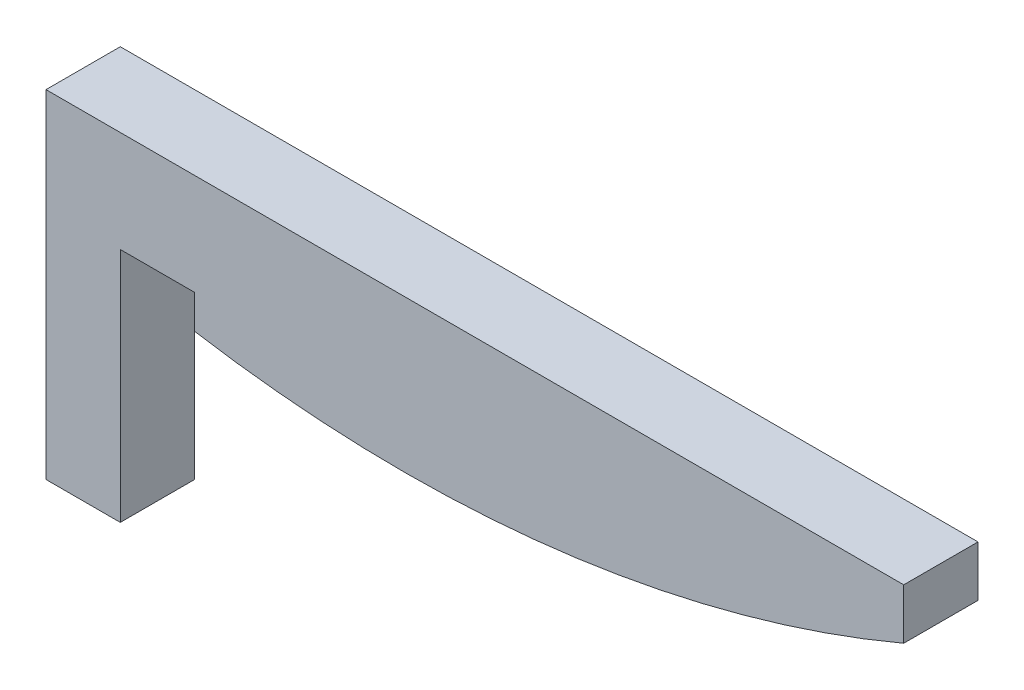
ISO-10303-21;
HEADER;
FILE_DESCRIPTION(('STEP AP214'),'2;1');
FILE_NAME('part.step','',(''),(''),'','','');
FILE_SCHEMA(('AUTOMOTIVE_DESIGN { 1 0 10303 214 1 1 1 1 }'));
ENDSEC;
DATA;
#1=APPLICATION_CONTEXT('core data for automotive mechanical design processes');
#2=APPLICATION_PROTOCOL_DEFINITION('international standard','automotive_design',2000,#1);
#3=PRODUCT_CONTEXT('',#1,'mechanical');
#4=PRODUCT('Part','Part','',(#3));
#5=PRODUCT_RELATED_PRODUCT_CATEGORY('part','',(#4));
#6=PRODUCT_DEFINITION_FORMATION('','',#4);
#7=PRODUCT_DEFINITION_CONTEXT('part definition',#1,'design');
#8=PRODUCT_DEFINITION('design','',#6,#7);
#9=PRODUCT_DEFINITION_SHAPE('','',#8);
#10=(LENGTH_UNIT() NAMED_UNIT(*) SI_UNIT(.MILLI.,.METRE.));
#11=(NAMED_UNIT(*) PLANE_ANGLE_UNIT() SI_UNIT($,.RADIAN.));
#12=(NAMED_UNIT(*) SI_UNIT($,.STERADIAN.) SOLID_ANGLE_UNIT());
#13=UNCERTAINTY_MEASURE_WITH_UNIT(LENGTH_MEASURE(1.E-05),#10,'distance_accuracy_value','');
#14=(GEOMETRIC_REPRESENTATION_CONTEXT(3) GLOBAL_UNCERTAINTY_ASSIGNED_CONTEXT((#13)) GLOBAL_UNIT_ASSIGNED_CONTEXT((#10,
#11,#12)) REPRESENTATION_CONTEXT('',''));
#15=CARTESIAN_POINT('',(0.,0.,0.));
#16=DIRECTION('',(0.,0.,1.));
#17=DIRECTION('',(1.,0.,0.));
#18=AXIS2_PLACEMENT_3D('',#15,#16,#17);
#19=CARTESIAN_POINT('',(96.6069144444629,71.1082138760036,0.));
#20=DIRECTION('',(0.,0.,1.));
#21=DIRECTION('',(1.,0.,0.));
#22=AXIS2_PLACEMENT_3D('',#19,#20,#21);
#23=PLANE('',#22);
#24=DIRECTION('',(-1.,0.,0.));
#25=VECTOR('',#24,1.);
#26=CARTESIAN_POINT('',(254.,100.,0.));
#27=LINE('',#26,#25);
#28=CARTESIAN_POINT('',(254.,100.,0.));
#29=VERTEX_POINT('',#28);
#30=CARTESIAN_POINT('',(0.,99.9999999999999,0.));
#31=VERTEX_POINT('',#30);
#32=EDGE_CURVE('E83',#29,#31,#27,.T.);
#33=ORIENTED_EDGE('',*,*,#32,.F.);
#34=DIRECTION('',(0.,1.,0.));
#35=VECTOR('',#34,1.);
#36=CARTESIAN_POINT('',(254.,85.,0.));
#37=LINE('',#36,#35);
#38=CARTESIAN_POINT('',(254.,84.9999999999997,0.));
#39=VERTEX_POINT('',#38);
#40=EDGE_CURVE('E81',#39,#29,#37,.T.);
#41=ORIENTED_EDGE('',*,*,#40,.F.);
#42=CARTESIAN_POINT('',(105.853307336964,434.932218369506,0.));
#43=DIRECTION('',(0.,0.,1.));
#44=DIRECTION('',(1.,0.,0.));
#45=AXIS2_PLACEMENT_3D('',#42,#43,#44);
#46=CIRCLE('',#45,380.);
#47=CARTESIAN_POINT('',(43.9999999999999,59.9999999999998,0.));
#48=VERTEX_POINT('',#47);
#49=EDGE_CURVE('E20',#48,#39,#46,.T.);
#50=ORIENTED_EDGE('',*,*,#49,.F.);
#51=DIRECTION('',(0.,1.,0.));
#52=VECTOR('',#51,1.);
#53=CARTESIAN_POINT('',(44.,70.,0.));
#54=LINE('',#53,#52);
#55=CARTESIAN_POINT('',(44.,70.,0.));
#56=VERTEX_POINT('',#55);
#57=EDGE_CURVE('E112',#56,#48,#54,.F.);
#58=ORIENTED_EDGE('',*,*,#57,.F.);
#59=DIRECTION('',(1.,0.,0.));
#60=VECTOR('',#59,1.);
#61=CARTESIAN_POINT('',(22.,70.,0.));
#62=LINE('',#61,#60);
#63=CARTESIAN_POINT('',(22.,70.,0.));
#64=VERTEX_POINT('',#63);
#65=EDGE_CURVE('E125',#64,#56,#62,.T.);
#66=ORIENTED_EDGE('',*,*,#65,.F.);
#67=DIRECTION('',(0.,1.,0.));
#68=VECTOR('',#67,1.);
#69=CARTESIAN_POINT('',(22.,0.,0.));
#70=LINE('',#69,#68);
#71=CARTESIAN_POINT('',(22.,0.,0.));
#72=VERTEX_POINT('',#71);
#73=EDGE_CURVE('E136',#72,#64,#70,.T.);
#74=ORIENTED_EDGE('',*,*,#73,.F.);
#75=DIRECTION('',(1.,0.,0.));
#76=VECTOR('',#75,1.);
#77=CARTESIAN_POINT('',(0.,0.,0.));
#78=LINE('',#77,#76);
#79=CARTESIAN_POINT('',(0.,0.,0.));
#80=VERTEX_POINT('',#79);
#81=EDGE_CURVE('E146',#80,#72,#78,.T.);
#82=ORIENTED_EDGE('',*,*,#81,.F.);
#83=DIRECTION('',(0.,1.,0.));
#84=VECTOR('',#83,1.);
#85=CARTESIAN_POINT('',(0.,100.,0.));
#86=LINE('',#85,#84);
#87=EDGE_CURVE('E161',#31,#80,#86,.F.);
#88=ORIENTED_EDGE('',*,*,#87,.F.);
#89=EDGE_LOOP('',(#33,#41,#50,#58,#66,#74,#82,#88));
#90=FACE_BOUND('',#89,.T.);
#91=ADVANCED_FACE('F17',(#90),#23,.F.);
#92=CARTESIAN_POINT('',(0.,100.,0.));
#93=DIRECTION('',(-1.,0.,0.));
#94=DIRECTION('',(0.,0.,1.));
#95=AXIS2_PLACEMENT_3D('',#92,#93,#94);
#96=PLANE('',#95);
#97=DIRECTION('',(0.,1.,0.));
#98=VECTOR('',#97,1.);
#99=CARTESIAN_POINT('',(0.,71.1082138760036,22.));
#100=LINE('',#99,#98);
#101=CARTESIAN_POINT('',(0.,100.,22.));
#102=VERTEX_POINT('',#101);
#103=CARTESIAN_POINT('',(0.,0.,22.));
#104=VERTEX_POINT('',#103);
#105=EDGE_CURVE('E106',#102,#104,#100,.F.);
#106=ORIENTED_EDGE('',*,*,#105,.F.);
#107=DIRECTION('',(0.,0.,1.));
#108=VECTOR('',#107,1.);
#109=CARTESIAN_POINT('',(0.,100.,0.));
#110=LINE('',#109,#108);
#111=EDGE_CURVE('E97',#31,#102,#110,.T.);
#112=ORIENTED_EDGE('',*,*,#111,.F.);
#113=ORIENTED_EDGE('',*,*,#87,.T.);
#114=DIRECTION('',(0.,0.,-1.));
#115=VECTOR('',#114,1.);
#116=CARTESIAN_POINT('',(0.,0.,0.));
#117=LINE('',#116,#115);
#118=EDGE_CURVE('E143',#104,#80,#117,.T.);
#119=ORIENTED_EDGE('',*,*,#118,.F.);
#120=EDGE_LOOP('',(#106,#112,#113,#119));
#121=FACE_BOUND('',#120,.T.);
#122=ADVANCED_FACE('F200',(#121),#96,.T.);
#123=CARTESIAN_POINT('',(0.,0.,0.));
#124=DIRECTION('',(0.,-1.,0.));
#125=DIRECTION('',(0.,0.,-1.));
#126=AXIS2_PLACEMENT_3D('',#123,#124,#125);
#127=PLANE('',#126);
#128=DIRECTION('',(1.,0.,0.));
#129=VECTOR('',#128,1.);
#130=CARTESIAN_POINT('',(96.6069144444629,0.,22.));
#131=LINE('',#130,#129);
#132=CARTESIAN_POINT('',(22.,0.,22.));
#133=VERTEX_POINT('',#132);
#134=EDGE_CURVE('E130',#104,#133,#131,.T.);
#135=ORIENTED_EDGE('',*,*,#134,.F.);
#136=ORIENTED_EDGE('',*,*,#118,.T.);
#137=ORIENTED_EDGE('',*,*,#81,.T.);
#138=DIRECTION('',(0.,0.,1.));
#139=VECTOR('',#138,1.);
#140=CARTESIAN_POINT('',(22.,0.,0.));
#141=LINE('',#140,#139);
#142=EDGE_CURVE('E133',#133,#72,#141,.F.);
#143=ORIENTED_EDGE('',*,*,#142,.F.);
#144=EDGE_LOOP('',(#135,#136,#137,#143));
#145=FACE_BOUND('',#144,.T.);
#146=ADVANCED_FACE('F198',(#145),#127,.T.);
#147=CARTESIAN_POINT('',(22.,0.,0.));
#148=DIRECTION('',(1.,0.,0.));
#149=DIRECTION('',(0.,1.,0.));
#150=AXIS2_PLACEMENT_3D('',#147,#148,#149);
#151=PLANE('',#150);
#152=DIRECTION('',(0.,1.,0.));
#153=VECTOR('',#152,1.);
#154=CARTESIAN_POINT('',(22.,71.1082138760036,22.));
#155=LINE('',#154,#153);
#156=CARTESIAN_POINT('',(22.,70.,22.));
#157=VERTEX_POINT('',#156);
#158=EDGE_CURVE('E119',#133,#157,#155,.T.);
#159=ORIENTED_EDGE('',*,*,#158,.F.);
#160=ORIENTED_EDGE('',*,*,#142,.T.);
#161=ORIENTED_EDGE('',*,*,#73,.T.);
#162=DIRECTION('',(0.,0.,1.));
#163=VECTOR('',#162,1.);
#164=CARTESIAN_POINT('',(22.,70.,0.));
#165=LINE('',#164,#163);
#166=EDGE_CURVE('E122',#157,#64,#165,.F.);
#167=ORIENTED_EDGE('',*,*,#166,.F.);
#168=EDGE_LOOP('',(#159,#160,#161,#167));
#169=FACE_BOUND('',#168,.T.);
#170=ADVANCED_FACE('F195',(#169),#151,.T.);
#171=CARTESIAN_POINT('',(22.,70.,0.));
#172=DIRECTION('',(0.,-1.,0.));
#173=DIRECTION('',(1.,0.,0.));
#174=AXIS2_PLACEMENT_3D('',#171,#172,#173);
#175=PLANE('',#174);
#176=DIRECTION('',(1.,0.,0.));
#177=VECTOR('',#176,1.);
#178=CARTESIAN_POINT('',(96.6069144444629,70.,22.));
#179=LINE('',#178,#177);
#180=CARTESIAN_POINT('',(44.,70.,22.));
#181=VERTEX_POINT('',#180);
#182=EDGE_CURVE('E115',#157,#181,#179,.T.);
#183=ORIENTED_EDGE('',*,*,#182,.F.);
#184=ORIENTED_EDGE('',*,*,#166,.T.);
#185=ORIENTED_EDGE('',*,*,#65,.T.);
#186=DIRECTION('',(0.,0.,1.));
#187=VECTOR('',#186,1.);
#188=CARTESIAN_POINT('',(44.,70.,0.));
#189=LINE('',#188,#187);
#190=EDGE_CURVE('E92',#181,#56,#189,.F.);
#191=ORIENTED_EDGE('',*,*,#190,.F.);
#192=EDGE_LOOP('',(#183,#184,#185,#191));
#193=FACE_BOUND('',#192,.T.);
#194=ADVANCED_FACE('F192',(#193),#175,.T.);
#195=CARTESIAN_POINT('',(44.,70.,0.));
#196=DIRECTION('',(-1.,0.,0.));
#197=DIRECTION('',(0.,0.,1.));
#198=AXIS2_PLACEMENT_3D('',#195,#196,#197);
#199=PLANE('',#198);
#200=DIRECTION('',(0.,1.,0.));
#201=VECTOR('',#200,1.);
#202=CARTESIAN_POINT('',(44.,71.1082138760036,22.));
#203=LINE('',#202,#201);
#204=CARTESIAN_POINT('',(43.9999999999999,59.9999999999998,22.));
#205=VERTEX_POINT('',#204);
#206=EDGE_CURVE('E118',#181,#205,#203,.F.);
#207=ORIENTED_EDGE('',*,*,#206,.F.);
#208=ORIENTED_EDGE('',*,*,#190,.T.);
#209=ORIENTED_EDGE('',*,*,#57,.T.);
#210=DIRECTION('',(0.,0.,1.));
#211=VECTOR('',#210,1.);
#212=CARTESIAN_POINT('',(43.9999999999998,59.9999999999998,0.));
#213=LINE('',#212,#211);
#214=EDGE_CURVE('E86',#205,#48,#213,.F.);
#215=ORIENTED_EDGE('',*,*,#214,.F.);
#216=EDGE_LOOP('',(#207,#208,#209,#215));
#217=FACE_BOUND('',#216,.T.);
#218=ADVANCED_FACE('F190',(#217),#199,.T.);
#219=CARTESIAN_POINT('',(105.853307336964,434.932218369506,0.));
#220=DIRECTION('',(0.,0.,1.));
#221=DIRECTION('',(1.,0.,0.));
#222=AXIS2_PLACEMENT_3D('',#219,#220,#221);
#223=CYLINDRICAL_SURFACE('',#222,380.);
#224=CARTESIAN_POINT('',(105.853307336964,434.932218369506,22.));
#225=DIRECTION('',(0.,0.,1.));
#226=DIRECTION('',(1.,0.,0.));
#227=AXIS2_PLACEMENT_3D('',#224,#225,#226);
#228=CIRCLE('',#227,380.);
#229=CARTESIAN_POINT('',(254.,84.9999999999997,22.));
#230=VERTEX_POINT('',#229);
#231=EDGE_CURVE('E180',#205,#230,#228,.T.);
#232=ORIENTED_EDGE('',*,*,#231,.F.);
#233=ORIENTED_EDGE('',*,*,#214,.T.);
#234=ORIENTED_EDGE('',*,*,#49,.T.);
#235=DIRECTION('',(0.,0.,1.));
#236=VECTOR('',#235,1.);
#237=CARTESIAN_POINT('',(254.,85.,0.));
#238=LINE('',#237,#236);
#239=EDGE_CURVE('E85',#230,#39,#238,.F.);
#240=ORIENTED_EDGE('',*,*,#239,.F.);
#241=EDGE_LOOP('',(#232,#233,#234,#240));
#242=FACE_BOUND('',#241,.T.);
#243=ADVANCED_FACE('F91',(#242),#223,.T.);
#244=CARTESIAN_POINT('',(254.,85.,0.));
#245=DIRECTION('',(1.,0.,0.));
#246=DIRECTION('',(0.,1.,0.));
#247=AXIS2_PLACEMENT_3D('',#244,#245,#246);
#248=PLANE('',#247);
#249=DIRECTION('',(0.,1.,0.));
#250=VECTOR('',#249,1.);
#251=CARTESIAN_POINT('',(254.,71.1082138760036,22.));
#252=LINE('',#251,#250);
#253=CARTESIAN_POINT('',(254.,100.,22.));
#254=VERTEX_POINT('',#253);
#255=EDGE_CURVE('E26',#230,#254,#252,.T.);
#256=ORIENTED_EDGE('',*,*,#255,.F.);
#257=ORIENTED_EDGE('',*,*,#239,.T.);
#258=ORIENTED_EDGE('',*,*,#40,.T.);
#259=DIRECTION('',(0.,0.,1.));
#260=VECTOR('',#259,1.);
#261=CARTESIAN_POINT('',(254.,100.,0.));
#262=LINE('',#261,#260);
#263=EDGE_CURVE('E35',#254,#29,#262,.F.);
#264=ORIENTED_EDGE('',*,*,#263,.F.);
#265=EDGE_LOOP('',(#256,#257,#258,#264));
#266=FACE_BOUND('',#265,.T.);
#267=ADVANCED_FACE('F93',(#266),#248,.T.);
#268=CARTESIAN_POINT('',(254.,100.,0.));
#269=DIRECTION('',(0.,1.,0.));
#270=DIRECTION('',(-1.,0.,0.));
#271=AXIS2_PLACEMENT_3D('',#268,#269,#270);
#272=PLANE('',#271);
#273=DIRECTION('',(1.,0.,0.));
#274=VECTOR('',#273,1.);
#275=CARTESIAN_POINT('',(96.6069144444629,100.,22.));
#276=LINE('',#275,#274);
#277=EDGE_CURVE('E11',#254,#102,#276,.F.);
#278=ORIENTED_EDGE('',*,*,#277,.F.);
#279=ORIENTED_EDGE('',*,*,#263,.T.);
#280=ORIENTED_EDGE('',*,*,#32,.T.);
#281=ORIENTED_EDGE('',*,*,#111,.T.);
#282=EDGE_LOOP('',(#278,#279,#280,#281));
#283=FACE_BOUND('',#282,.T.);
#284=ADVANCED_FACE('F203',(#283),#272,.T.);
#285=CARTESIAN_POINT('',(96.6069144444629,71.1082138760036,22.));
#286=DIRECTION('',(0.,0.,1.));
#287=DIRECTION('',(1.,0.,0.));
#288=AXIS2_PLACEMENT_3D('',#285,#286,#287);
#289=PLANE('',#288);
#290=ORIENTED_EDGE('',*,*,#255,.T.);
#291=ORIENTED_EDGE('',*,*,#277,.T.);
#292=ORIENTED_EDGE('',*,*,#105,.T.);
#293=ORIENTED_EDGE('',*,*,#134,.T.);
#294=ORIENTED_EDGE('',*,*,#158,.T.);
#295=ORIENTED_EDGE('',*,*,#182,.T.);
#296=ORIENTED_EDGE('',*,*,#206,.T.);
#297=ORIENTED_EDGE('',*,*,#231,.T.);
#298=EDGE_LOOP('',(#290,#291,#292,#293,#294,#295,#296,#297));
#299=FACE_BOUND('',#298,.T.);
#300=ADVANCED_FACE('F187',(#299),#289,.T.);
#301=CLOSED_SHELL('',(#91,#122,#146,#170,#194,#218,#243,#267,#284,#300));
#302=MANIFOLD_SOLID_BREP('B1',#301);
#303=ADVANCED_BREP_SHAPE_REPRESENTATION('',(#18,#302),#14);
#304=SHAPE_DEFINITION_REPRESENTATION(#9,#303);
ENDSEC;
END-ISO-10303-21;
